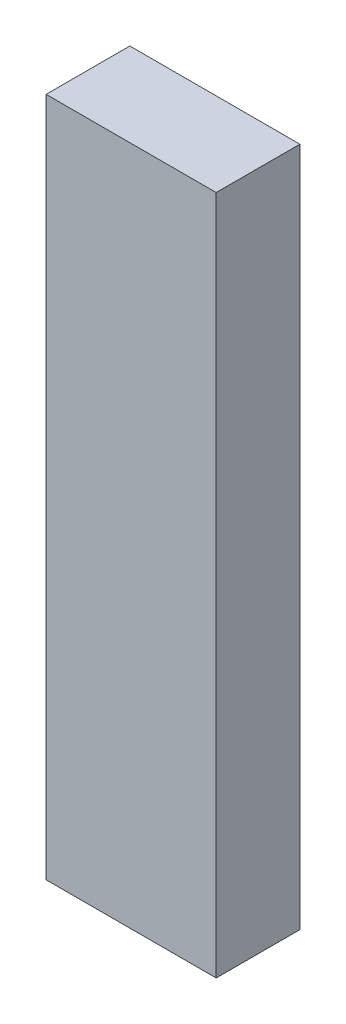
ISO-10303-21;
HEADER;
FILE_DESCRIPTION(('STEP AP214'),'2;1');
FILE_NAME('part.step','',(''),(''),'','','');
FILE_SCHEMA(('AUTOMOTIVE_DESIGN { 1 0 10303 214 1 1 1 1 }'));
ENDSEC;
DATA;
#1=APPLICATION_CONTEXT('core data for automotive mechanical design processes');
#2=APPLICATION_PROTOCOL_DEFINITION('international standard','automotive_design',2000,#1);
#3=PRODUCT_CONTEXT('',#1,'mechanical');
#4=PRODUCT('Part','Part','',(#3));
#5=PRODUCT_RELATED_PRODUCT_CATEGORY('part','',(#4));
#6=PRODUCT_DEFINITION_FORMATION('','',#4);
#7=PRODUCT_DEFINITION_CONTEXT('part definition',#1,'design');
#8=PRODUCT_DEFINITION('design','',#6,#7);
#9=PRODUCT_DEFINITION_SHAPE('','',#8);
#10=(LENGTH_UNIT() NAMED_UNIT(*) SI_UNIT(.MILLI.,.METRE.));
#11=(NAMED_UNIT(*) PLANE_ANGLE_UNIT() SI_UNIT($,.RADIAN.));
#12=(NAMED_UNIT(*) SI_UNIT($,.STERADIAN.) SOLID_ANGLE_UNIT());
#13=UNCERTAINTY_MEASURE_WITH_UNIT(LENGTH_MEASURE(1.E-05),#10,'distance_accuracy_value','');
#14=(GEOMETRIC_REPRESENTATION_CONTEXT(3) GLOBAL_UNCERTAINTY_ASSIGNED_CONTEXT((#13)) GLOBAL_UNIT_ASSIGNED_CONTEXT((#10,
#11,#12)) REPRESENTATION_CONTEXT('',''));
#15=CARTESIAN_POINT('',(0.,0.,0.));
#16=DIRECTION('',(0.,0.,1.));
#17=DIRECTION('',(1.,0.,0.));
#18=AXIS2_PLACEMENT_3D('',#15,#16,#17);
#19=CARTESIAN_POINT('',(-0.3250057,-3.71420136,0.31999936));
#20=DIRECTION('',(0.,0.,-1.));
#21=DIRECTION('',(-1.,0.,0.));
#22=AXIS2_PLACEMENT_3D('',#19,#20,#21);
#23=PLANE('',#22);
#24=DIRECTION('',(1.,0.,0.));
#25=VECTOR('',#24,1.);
#26=CARTESIAN_POINT('',(-0.3250057,-6.31420124,0.31999936));
#27=LINE('',#26,#25);
#28=CARTESIAN_POINT('',(-0.3250057,-6.31420124,0.31999936));
#29=VERTEX_POINT('',#28);
#30=CARTESIAN_POINT('',(0.32499554,-6.31420124,0.31999936));
#31=VERTEX_POINT('',#30);
#32=EDGE_CURVE('E54',#29,#31,#27,.T.);
#33=ORIENTED_EDGE('',*,*,#32,.T.);
#34=DIRECTION('',(0.,1.,0.));
#35=VECTOR('',#34,1.);
#36=CARTESIAN_POINT('',(0.32499554,-6.31420124,0.31999936));
#37=LINE('',#36,#35);
#38=CARTESIAN_POINT('',(0.32499554,-3.71420136,0.31999936));
#39=VERTEX_POINT('',#38);
#40=EDGE_CURVE('E56',#31,#39,#37,.T.);
#41=ORIENTED_EDGE('',*,*,#40,.T.);
#42=DIRECTION('',(1.,0.,0.));
#43=VECTOR('',#42,1.);
#44=CARTESIAN_POINT('',(0.32499554,-3.71420136,0.31999936));
#45=LINE('',#44,#43);
#46=CARTESIAN_POINT('',(-0.3250057,-3.71420136,0.31999936));
#47=VERTEX_POINT('',#46);
#48=EDGE_CURVE('E19',#39,#47,#45,.F.);
#49=ORIENTED_EDGE('',*,*,#48,.T.);
#50=DIRECTION('',(0.,1.,0.));
#51=VECTOR('',#50,1.);
#52=CARTESIAN_POINT('',(-0.3250057,-3.71420136,0.31999936));
#53=LINE('',#52,#51);
#54=EDGE_CURVE('E79',#47,#29,#53,.F.);
#55=ORIENTED_EDGE('',*,*,#54,.T.);
#56=EDGE_LOOP('',(#33,#41,#49,#55));
#57=FACE_BOUND('',#56,.T.);
#58=ADVANCED_FACE('F16',(#57),#23,.F.);
#59=CARTESIAN_POINT('',(0.32499554,-3.71420136,0.));
#60=DIRECTION('',(0.,-1.,0.));
#61=DIRECTION('',(0.,0.,-1.));
#62=AXIS2_PLACEMENT_3D('',#59,#60,#61);
#63=PLANE('',#62);
#64=DIRECTION('',(0.,0.,-1.));
#65=VECTOR('',#64,1.);
#66=CARTESIAN_POINT('',(-0.3250057,-3.71420136,0.));
#67=LINE('',#66,#65);
#68=CARTESIAN_POINT('',(-0.3250057,-3.71420136,0.));
#69=VERTEX_POINT('',#68);
#70=EDGE_CURVE('E67',#69,#47,#67,.F.);
#71=ORIENTED_EDGE('',*,*,#70,.T.);
#72=ORIENTED_EDGE('',*,*,#48,.F.);
#73=DIRECTION('',(0.,0.,1.));
#74=VECTOR('',#73,1.);
#75=CARTESIAN_POINT('',(0.32499554,-3.71420136,0.));
#76=LINE('',#75,#74);
#77=CARTESIAN_POINT('',(0.32499554,-3.71420136,0.));
#78=VERTEX_POINT('',#77);
#79=EDGE_CURVE('E62',#39,#78,#76,.F.);
#80=ORIENTED_EDGE('',*,*,#79,.T.);
#81=DIRECTION('',(-1.,0.,0.));
#82=VECTOR('',#81,1.);
#83=CARTESIAN_POINT('',(-0.3250057,-3.71420136,0.));
#84=LINE('',#83,#82);
#85=EDGE_CURVE('E82',#69,#78,#84,.F.);
#86=ORIENTED_EDGE('',*,*,#85,.F.);
#87=EDGE_LOOP('',(#71,#72,#80,#86));
#88=FACE_BOUND('',#87,.T.);
#89=ADVANCED_FACE('F64',(#88),#63,.F.);
#90=CARTESIAN_POINT('',(0.32499554,-6.31420124,0.));
#91=DIRECTION('',(-1.,0.,0.));
#92=DIRECTION('',(0.,0.,1.));
#93=AXIS2_PLACEMENT_3D('',#90,#91,#92);
#94=PLANE('',#93);
#95=ORIENTED_EDGE('',*,*,#79,.F.);
#96=ORIENTED_EDGE('',*,*,#40,.F.);
#97=DIRECTION('',(0.,0.,1.));
#98=VECTOR('',#97,1.);
#99=CARTESIAN_POINT('',(0.32499554,-6.31420124,0.));
#100=LINE('',#99,#98);
#101=CARTESIAN_POINT('',(0.32499554,-6.31420124,0.));
#102=VERTEX_POINT('',#101);
#103=EDGE_CURVE('E74',#31,#102,#100,.F.);
#104=ORIENTED_EDGE('',*,*,#103,.T.);
#105=DIRECTION('',(0.,1.,0.));
#106=VECTOR('',#105,1.);
#107=CARTESIAN_POINT('',(0.32499554,-3.71420136,0.));
#108=LINE('',#107,#106);
#109=EDGE_CURVE('E71',#78,#102,#108,.F.);
#110=ORIENTED_EDGE('',*,*,#109,.F.);
#111=EDGE_LOOP('',(#95,#96,#104,#110));
#112=FACE_BOUND('',#111,.T.);
#113=ADVANCED_FACE('F69',(#112),#94,.F.);
#114=CARTESIAN_POINT('',(-0.3250057,-6.31420124,0.));
#115=DIRECTION('',(0.,1.,0.));
#116=DIRECTION('',(0.,0.,1.));
#117=AXIS2_PLACEMENT_3D('',#114,#115,#116);
#118=PLANE('',#117);
#119=ORIENTED_EDGE('',*,*,#103,.F.);
#120=ORIENTED_EDGE('',*,*,#32,.F.);
#121=DIRECTION('',(0.,0.,-1.));
#122=VECTOR('',#121,1.);
#123=CARTESIAN_POINT('',(-0.3250057,-6.31420124,0.));
#124=LINE('',#123,#122);
#125=CARTESIAN_POINT('',(-0.3250057,-6.31420124,0.));
#126=VERTEX_POINT('',#125);
#127=EDGE_CURVE('E34',#29,#126,#124,.T.);
#128=ORIENTED_EDGE('',*,*,#127,.T.);
#129=DIRECTION('',(-1.,0.,0.));
#130=VECTOR('',#129,1.);
#131=CARTESIAN_POINT('',(-0.3250057,-6.31420124,0.));
#132=LINE('',#131,#130);
#133=EDGE_CURVE('E25',#102,#126,#132,.T.);
#134=ORIENTED_EDGE('',*,*,#133,.F.);
#135=EDGE_LOOP('',(#119,#120,#128,#134));
#136=FACE_BOUND('',#135,.T.);
#137=ADVANCED_FACE('F88',(#136),#118,.F.);
#138=CARTESIAN_POINT('',(-0.3250057,-3.71420136,0.));
#139=DIRECTION('',(1.,0.,0.));
#140=DIRECTION('',(0.,0.,-1.));
#141=AXIS2_PLACEMENT_3D('',#138,#139,#140);
#142=PLANE('',#141);
#143=ORIENTED_EDGE('',*,*,#127,.F.);
#144=ORIENTED_EDGE('',*,*,#54,.F.);
#145=ORIENTED_EDGE('',*,*,#70,.F.);
#146=DIRECTION('',(0.,1.,0.));
#147=VECTOR('',#146,1.);
#148=CARTESIAN_POINT('',(-0.3250057,-3.71420136,0.));
#149=LINE('',#148,#147);
#150=EDGE_CURVE('E11',#126,#69,#149,.T.);
#151=ORIENTED_EDGE('',*,*,#150,.F.);
#152=EDGE_LOOP('',(#143,#144,#145,#151));
#153=FACE_BOUND('',#152,.T.);
#154=ADVANCED_FACE('F90',(#153),#142,.F.);
#155=CARTESIAN_POINT('',(-0.3250057,-3.71420136,0.));
#156=DIRECTION('',(0.,0.,-1.));
#157=DIRECTION('',(-1.,0.,0.));
#158=AXIS2_PLACEMENT_3D('',#155,#156,#157);
#159=PLANE('',#158);
#160=ORIENTED_EDGE('',*,*,#133,.T.);
#161=ORIENTED_EDGE('',*,*,#150,.T.);
#162=ORIENTED_EDGE('',*,*,#85,.T.);
#163=ORIENTED_EDGE('',*,*,#109,.T.);
#164=EDGE_LOOP('',(#160,#161,#162,#163));
#165=FACE_BOUND('',#164,.T.);
#166=ADVANCED_FACE('F87',(#165),#159,.T.);
#167=CLOSED_SHELL('',(#58,#89,#113,#137,#154,#166));
#168=MANIFOLD_SOLID_BREP('B1',#167);
#169=ADVANCED_BREP_SHAPE_REPRESENTATION('',(#18,#168),#14);
#170=SHAPE_DEFINITION_REPRESENTATION(#9,#169);
ENDSEC;
END-ISO-10303-21;
